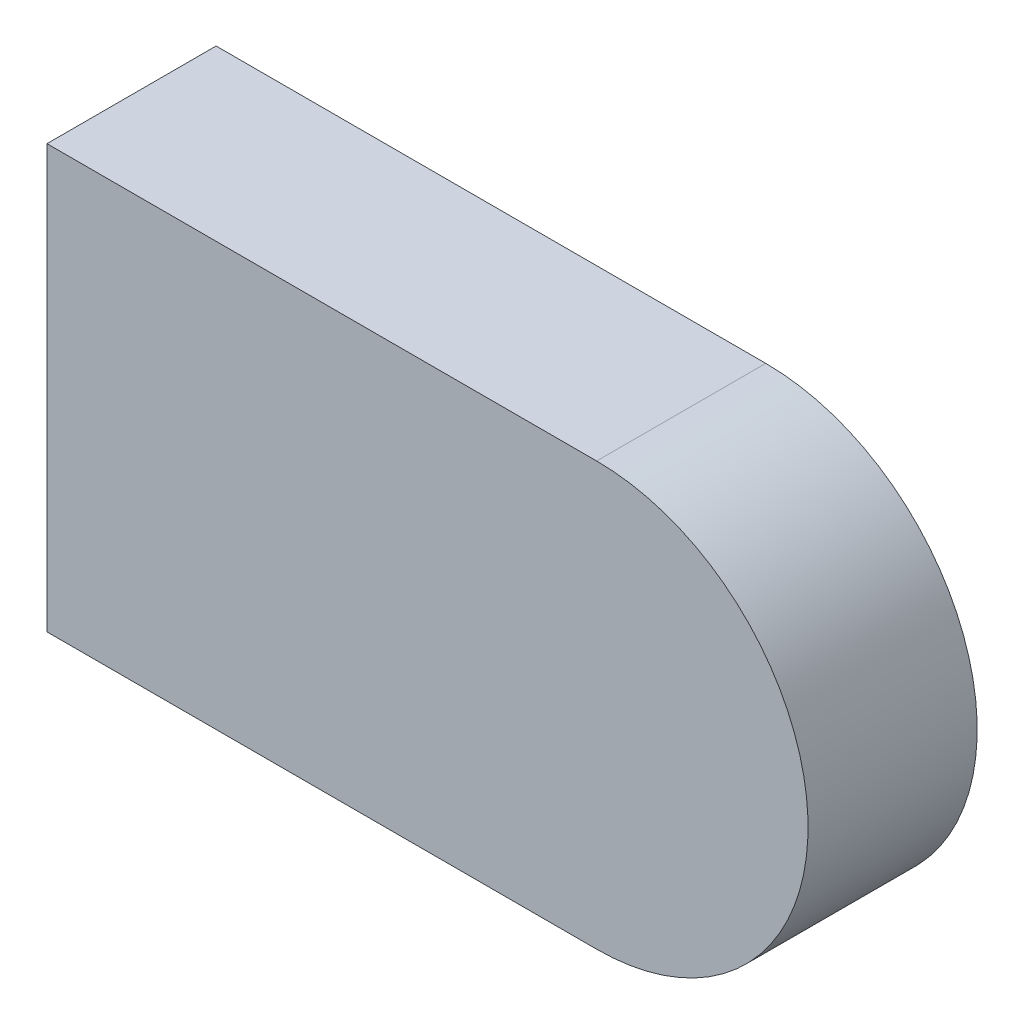
ISO-10303-21;
HEADER;
FILE_DESCRIPTION(('STEP AP214'),'2;1');
FILE_NAME('part.step','',(''),(''),'','','');
FILE_SCHEMA(('AUTOMOTIVE_DESIGN { 1 0 10303 214 1 1 1 1 }'));
ENDSEC;
DATA;
#1=APPLICATION_CONTEXT('core data for automotive mechanical design processes');
#2=APPLICATION_PROTOCOL_DEFINITION('international standard','automotive_design',2000,#1);
#3=PRODUCT_CONTEXT('',#1,'mechanical');
#4=PRODUCT('Part','Part','',(#3));
#5=PRODUCT_RELATED_PRODUCT_CATEGORY('part','',(#4));
#6=PRODUCT_DEFINITION_FORMATION('','',#4);
#7=PRODUCT_DEFINITION_CONTEXT('part definition',#1,'design');
#8=PRODUCT_DEFINITION('design','',#6,#7);
#9=PRODUCT_DEFINITION_SHAPE('','',#8);
#10=(LENGTH_UNIT() NAMED_UNIT(*) SI_UNIT(.MILLI.,.METRE.));
#11=(NAMED_UNIT(*) PLANE_ANGLE_UNIT() SI_UNIT($,.RADIAN.));
#12=(NAMED_UNIT(*) SI_UNIT($,.STERADIAN.) SOLID_ANGLE_UNIT());
#13=UNCERTAINTY_MEASURE_WITH_UNIT(LENGTH_MEASURE(1.E-05),#10,'distance_accuracy_value','');
#14=(GEOMETRIC_REPRESENTATION_CONTEXT(3) GLOBAL_UNCERTAINTY_ASSIGNED_CONTEXT((#13)) GLOBAL_UNIT_ASSIGNED_CONTEXT((#10,
#11,#12)) REPRESENTATION_CONTEXT('',''));
#15=CARTESIAN_POINT('',(0.,0.,0.));
#16=DIRECTION('',(0.,0.,1.));
#17=DIRECTION('',(1.,0.,0.));
#18=AXIS2_PLACEMENT_3D('',#15,#16,#17);
#19=CARTESIAN_POINT('',(-2.05,-0.875,0.));
#20=DIRECTION('',(0.,1.,0.));
#21=DIRECTION('',(1.,0.,0.));
#22=AXIS2_PLACEMENT_3D('',#19,#20,#21);
#23=PLANE('',#22);
#24=DIRECTION('',(1.,0.,0.));
#25=VECTOR('',#24,1.);
#26=CARTESIAN_POINT('',(-2.05,-0.875,0.));
#27=LINE('',#26,#25);
#28=CARTESIAN_POINT('',(-2.05,-0.875,0.));
#29=VERTEX_POINT('',#28);
#30=CARTESIAN_POINT('',(-1.725,-0.875,0.));
#31=VERTEX_POINT('',#30);
#32=EDGE_CURVE('E11',#29,#31,#27,.T.);
#33=ORIENTED_EDGE('',*,*,#32,.T.);
#34=DIRECTION('',(0.,0.,1.));
#35=VECTOR('',#34,1.);
#36=CARTESIAN_POINT('',(-1.725,-0.875,0.));
#37=LINE('',#36,#35);
#38=CARTESIAN_POINT('',(-1.725,-0.875,0.1));
#39=VERTEX_POINT('',#38);
#40=EDGE_CURVE('E24',#31,#39,#37,.T.);
#41=ORIENTED_EDGE('',*,*,#40,.T.);
#42=DIRECTION('',(1.,0.,0.));
#43=VECTOR('',#42,1.);
#44=CARTESIAN_POINT('',(-2.05,-0.875,0.1));
#45=LINE('',#44,#43);
#46=CARTESIAN_POINT('',(-2.05,-0.875,0.1));
#47=VERTEX_POINT('',#46);
#48=EDGE_CURVE('E88',#47,#39,#45,.T.);
#49=ORIENTED_EDGE('',*,*,#48,.F.);
#50=DIRECTION('',(0.,0.,1.));
#51=VECTOR('',#50,1.);
#52=CARTESIAN_POINT('',(-2.05,-0.875,0.));
#53=LINE('',#52,#51);
#54=EDGE_CURVE('E36',#29,#47,#53,.T.);
#55=ORIENTED_EDGE('',*,*,#54,.F.);
#56=EDGE_LOOP('',(#33,#41,#49,#55));
#57=FACE_BOUND('',#56,.T.);
#58=ADVANCED_FACE('F17',(#57),#23,.F.);
#59=CARTESIAN_POINT('',(-1.725,-0.75,0.));
#60=DIRECTION('',(0.,0.,-1.));
#61=DIRECTION('',(1.,0.,0.));
#62=AXIS2_PLACEMENT_3D('',#59,#60,#61);
#63=CYLINDRICAL_SURFACE('',#62,0.125);
#64=CARTESIAN_POINT('',(-1.725,-0.75,0.));
#65=DIRECTION('',(0.,0.,1.));
#66=DIRECTION('',(1.,0.,0.));
#67=AXIS2_PLACEMENT_3D('',#64,#65,#66);
#68=CIRCLE('',#67,0.125);
#69=CARTESIAN_POINT('',(-1.725,-0.625,0.));
#70=VERTEX_POINT('',#69);
#71=EDGE_CURVE('E85',#31,#70,#68,.T.);
#72=ORIENTED_EDGE('',*,*,#71,.T.);
#73=DIRECTION('',(0.,0.,1.));
#74=VECTOR('',#73,1.);
#75=CARTESIAN_POINT('',(-1.725,-0.625,0.));
#76=LINE('',#75,#74);
#77=CARTESIAN_POINT('',(-1.725,-0.625,0.1));
#78=VERTEX_POINT('',#77);
#79=EDGE_CURVE('E73',#70,#78,#76,.T.);
#80=ORIENTED_EDGE('',*,*,#79,.T.);
#81=CARTESIAN_POINT('',(-1.725,-0.75,0.1));
#82=DIRECTION('',(0.,0.,1.));
#83=DIRECTION('',(1.,0.,0.));
#84=AXIS2_PLACEMENT_3D('',#81,#82,#83);
#85=CIRCLE('',#84,0.125);
#86=EDGE_CURVE('E66',#39,#78,#85,.T.);
#87=ORIENTED_EDGE('',*,*,#86,.F.);
#88=ORIENTED_EDGE('',*,*,#40,.F.);
#89=EDGE_LOOP('',(#72,#80,#87,#88));
#90=FACE_BOUND('',#89,.T.);
#91=ADVANCED_FACE('F89',(#90),#63,.T.);
#92=CARTESIAN_POINT('',(-2.05,-0.625,0.));
#93=DIRECTION('',(0.,1.,0.));
#94=DIRECTION('',(1.,0.,0.));
#95=AXIS2_PLACEMENT_3D('',#92,#93,#94);
#96=PLANE('',#95);
#97=DIRECTION('',(0.,0.,1.));
#98=VECTOR('',#97,1.);
#99=CARTESIAN_POINT('',(-2.05,-0.625,0.));
#100=LINE('',#99,#98);
#101=CARTESIAN_POINT('',(-2.05,-0.625,0.));
#102=VERTEX_POINT('',#101);
#103=CARTESIAN_POINT('',(-2.05,-0.625,0.1));
#104=VERTEX_POINT('',#103);
#105=EDGE_CURVE('E56',#102,#104,#100,.T.);
#106=ORIENTED_EDGE('',*,*,#105,.T.);
#107=DIRECTION('',(1.,0.,0.));
#108=VECTOR('',#107,1.);
#109=CARTESIAN_POINT('',(-2.05,-0.625,0.1));
#110=LINE('',#109,#108);
#111=EDGE_CURVE('E67',#104,#78,#110,.T.);
#112=ORIENTED_EDGE('',*,*,#111,.T.);
#113=ORIENTED_EDGE('',*,*,#79,.F.);
#114=DIRECTION('',(1.,0.,0.));
#115=VECTOR('',#114,1.);
#116=CARTESIAN_POINT('',(-2.05,-0.625,0.));
#117=LINE('',#116,#115);
#118=EDGE_CURVE('E71',#102,#70,#117,.T.);
#119=ORIENTED_EDGE('',*,*,#118,.F.);
#120=EDGE_LOOP('',(#106,#112,#113,#119));
#121=FACE_BOUND('',#120,.T.);
#122=ADVANCED_FACE('F72',(#121),#96,.T.);
#123=CARTESIAN_POINT('',(-2.05,-0.875,0.));
#124=DIRECTION('',(-1.,0.,0.));
#125=DIRECTION('',(0.,1.,0.));
#126=AXIS2_PLACEMENT_3D('',#123,#124,#125);
#127=PLANE('',#126);
#128=ORIENTED_EDGE('',*,*,#54,.T.);
#129=DIRECTION('',(0.,1.,0.));
#130=VECTOR('',#129,1.);
#131=CARTESIAN_POINT('',(-2.05,-0.875,0.1));
#132=LINE('',#131,#130);
#133=EDGE_CURVE('E62',#47,#104,#132,.T.);
#134=ORIENTED_EDGE('',*,*,#133,.T.);
#135=ORIENTED_EDGE('',*,*,#105,.F.);
#136=DIRECTION('',(0.,1.,0.));
#137=VECTOR('',#136,1.);
#138=CARTESIAN_POINT('',(-2.05,-0.875,0.));
#139=LINE('',#138,#137);
#140=EDGE_CURVE('E60',#29,#102,#139,.T.);
#141=ORIENTED_EDGE('',*,*,#140,.F.);
#142=EDGE_LOOP('',(#128,#134,#135,#141));
#143=FACE_BOUND('',#142,.T.);
#144=ADVANCED_FACE('F58',(#143),#127,.T.);
#145=CARTESIAN_POINT('',(-1.850342514613,-0.75,0.));
#146=DIRECTION('',(0.,0.,1.));
#147=DIRECTION('',(1.,0.,0.));
#148=AXIS2_PLACEMENT_3D('',#145,#146,#147);
#149=PLANE('',#148);
#150=ORIENTED_EDGE('',*,*,#140,.T.);
#151=ORIENTED_EDGE('',*,*,#118,.T.);
#152=ORIENTED_EDGE('',*,*,#71,.F.);
#153=ORIENTED_EDGE('',*,*,#32,.F.);
#154=EDGE_LOOP('',(#150,#151,#152,#153));
#155=FACE_BOUND('',#154,.T.);
#156=ADVANCED_FACE('F77',(#155),#149,.F.);
#157=CARTESIAN_POINT('',(-1.850342514613,-0.75,0.1));
#158=DIRECTION('',(0.,0.,1.));
#159=DIRECTION('',(1.,0.,0.));
#160=AXIS2_PLACEMENT_3D('',#157,#158,#159);
#161=PLANE('',#160);
#162=ORIENTED_EDGE('',*,*,#48,.T.);
#163=ORIENTED_EDGE('',*,*,#86,.T.);
#164=ORIENTED_EDGE('',*,*,#111,.F.);
#165=ORIENTED_EDGE('',*,*,#133,.F.);
#166=EDGE_LOOP('',(#162,#163,#164,#165));
#167=FACE_BOUND('',#166,.T.);
#168=ADVANCED_FACE('F91',(#167),#161,.T.);
#169=CLOSED_SHELL('',(#58,#91,#122,#144,#156,#168));
#170=MANIFOLD_SOLID_BREP('B1',#169);
#171=ADVANCED_BREP_SHAPE_REPRESENTATION('',(#18,#170),#14);
#172=SHAPE_DEFINITION_REPRESENTATION(#9,#171);
ENDSEC;
END-ISO-10303-21;
